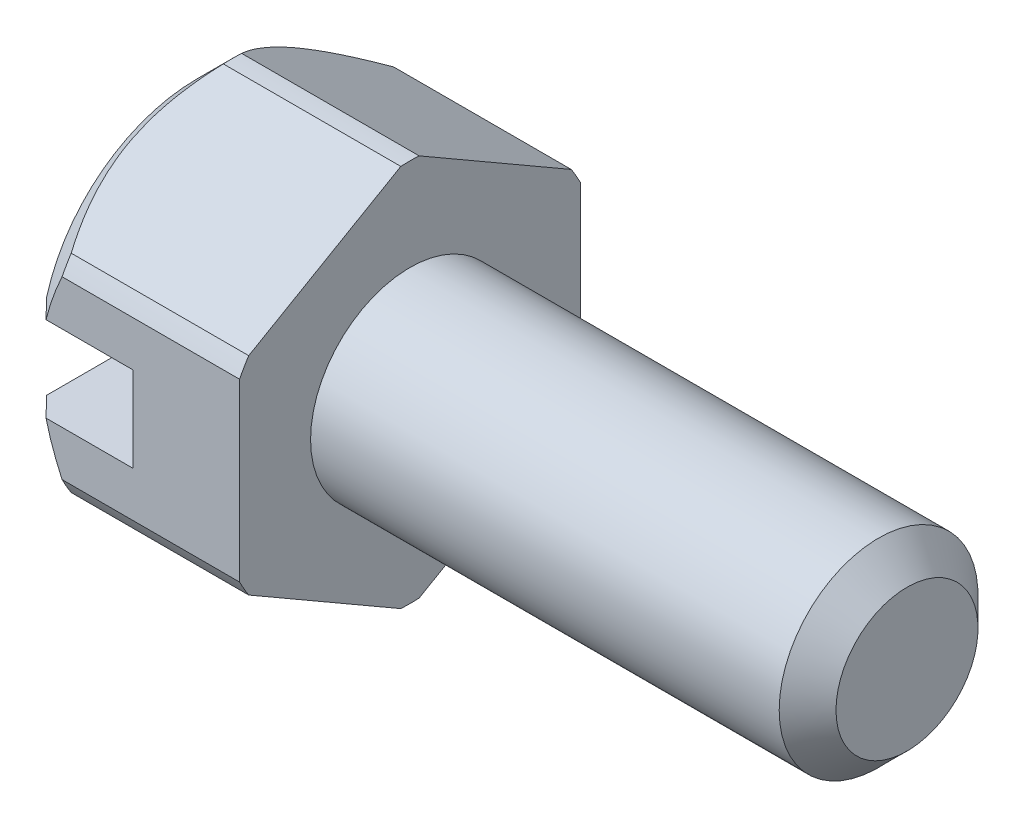
ISO-10303-21;
HEADER;
FILE_DESCRIPTION(('STEP AP214'),'2;1');
FILE_NAME('part.step','',(''),(''),'','','');
FILE_SCHEMA(('AUTOMOTIVE_DESIGN { 1 0 10303 214 1 1 1 1 }'));
ENDSEC;
DATA;
#1=APPLICATION_CONTEXT('core data for automotive mechanical design processes');
#2=APPLICATION_PROTOCOL_DEFINITION('international standard','automotive_design',2000,#1);
#3=PRODUCT_CONTEXT('',#1,'mechanical');
#4=PRODUCT('Part','Part','',(#3));
#5=PRODUCT_RELATED_PRODUCT_CATEGORY('part','',(#4));
#6=PRODUCT_DEFINITION_FORMATION('','',#4);
#7=PRODUCT_DEFINITION_CONTEXT('part definition',#1,'design');
#8=PRODUCT_DEFINITION('design','',#6,#7);
#9=PRODUCT_DEFINITION_SHAPE('','',#8);
#10=(LENGTH_UNIT() NAMED_UNIT(*) SI_UNIT(.MILLI.,.METRE.));
#11=(NAMED_UNIT(*) PLANE_ANGLE_UNIT() SI_UNIT($,.RADIAN.));
#12=(NAMED_UNIT(*) SI_UNIT($,.STERADIAN.) SOLID_ANGLE_UNIT());
#13=UNCERTAINTY_MEASURE_WITH_UNIT(LENGTH_MEASURE(1.E-05),#10,'distance_accuracy_value','');
#14=(GEOMETRIC_REPRESENTATION_CONTEXT(3) GLOBAL_UNCERTAINTY_ASSIGNED_CONTEXT((#13)) GLOBAL_UNIT_ASSIGNED_CONTEXT((#10,
#11,#12)) REPRESENTATION_CONTEXT('',''));
#15=CARTESIAN_POINT('',(0.,0.,0.));
#16=DIRECTION('',(0.,0.,1.));
#17=DIRECTION('',(1.,0.,0.));
#18=AXIS2_PLACEMENT_3D('',#15,#16,#17);
#19=CARTESIAN_POINT('',(-1.29409529997819,0.,0.));
#20=DIRECTION('',(-1.,0.,0.));
#21=DIRECTION('',(0.,0.,1.));
#22=AXIS2_PLACEMENT_3D('',#19,#20,#21);
#23=CYLINDRICAL_SURFACE('',#22,2.7);
#24=CARTESIAN_POINT('',(0.500000000000001,0.,0.));
#25=DIRECTION('',(-1.,0.,0.));
#26=DIRECTION('',(0.,0.,1.));
#27=AXIS2_PLACEMENT_3D('',#24,#25,#26);
#28=CIRCLE('',#27,2.7);
#29=CARTESIAN_POINT('',(0.500000000000001,-1.45999512524001,-2.27121426428142));
#30=VERTEX_POINT('',#29);
#31=CARTESIAN_POINT('',(0.500000000000001,-1.23693168768529,-2.4));
#32=VERTEX_POINT('',#31);
#33=EDGE_CURVE('E175',#30,#32,#28,.F.);
#34=ORIENTED_EDGE('',*,*,#33,.T.);
#35=DIRECTION('',(1.,0.,0.));
#36=VECTOR('',#35,1.);
#37=CARTESIAN_POINT('',(0.,-1.23693168768529,-2.4));
#38=LINE('',#37,#36);
#39=CARTESIAN_POINT('',(3.,-1.23693168768529,-2.4));
#40=VERTEX_POINT('',#39);
#41=EDGE_CURVE('E161',#32,#40,#38,.T.);
#42=ORIENTED_EDGE('',*,*,#41,.T.);
#43=CARTESIAN_POINT('',(3.,0.,0.));
#44=DIRECTION('',(-1.,0.,0.));
#45=DIRECTION('',(0.,0.,1.));
#46=AXIS2_PLACEMENT_3D('',#43,#44,#45);
#47=CIRCLE('',#46,2.7);
#48=CARTESIAN_POINT('',(3.,-1.45999512524001,-2.27121426428142));
#49=VERTEX_POINT('',#48);
#50=EDGE_CURVE('E172',#40,#49,#47,.T.);
#51=ORIENTED_EDGE('',*,*,#50,.T.);
#52=DIRECTION('',(1.,0.,0.));
#53=VECTOR('',#52,1.);
#54=CARTESIAN_POINT('',(0.,-1.45999512524001,-2.27121426428142));
#55=LINE('',#54,#53);
#56=EDGE_CURVE('E301',#30,#49,#55,.T.);
#57=ORIENTED_EDGE('',*,*,#56,.F.);
#58=EDGE_LOOP('',(#34,#42,#51,#57));
#59=FACE_BOUND('',#58,.T.);
#60=ADVANCED_FACE('F35',(#59),#23,.T.);
#61=CARTESIAN_POINT('',(3.,1.45999512524001,-2.27121426428142));
#62=VERTEX_POINT('',#61);
#63=CARTESIAN_POINT('',(3.,1.23693168768529,-2.4));
#64=VERTEX_POINT('',#63);
#65=EDGE_CURVE('E181',#62,#64,#47,.T.);
#66=ORIENTED_EDGE('',*,*,#65,.T.);
#67=DIRECTION('',(1.,0.,0.));
#68=VECTOR('',#67,1.);
#69=CARTESIAN_POINT('',(0.,1.23693168768529,-2.4));
#70=LINE('',#69,#68);
#71=CARTESIAN_POINT('',(0.500000000000001,1.23693168768529,-2.4));
#72=VERTEX_POINT('',#71);
#73=EDGE_CURVE('E163',#72,#64,#70,.T.);
#74=ORIENTED_EDGE('',*,*,#73,.F.);
#75=CARTESIAN_POINT('',(0.500000000000001,0.,0.));
#76=DIRECTION('',(-1.,0.,0.));
#77=DIRECTION('',(0.,0.,1.));
#78=AXIS2_PLACEMENT_3D('',#75,#76,#77);
#79=CIRCLE('',#78,2.7);
#80=CARTESIAN_POINT('',(0.500000000000001,1.45999512524001,-2.27121426428142));
#81=VERTEX_POINT('',#80);
#82=EDGE_CURVE('E415',#72,#81,#79,.F.);
#83=ORIENTED_EDGE('',*,*,#82,.T.);
#84=DIRECTION('',(1.,0.,0.));
#85=VECTOR('',#84,1.);
#86=CARTESIAN_POINT('',(0.,1.45999512524001,-2.27121426428142));
#87=LINE('',#86,#85);
#88=EDGE_CURVE('E349',#81,#62,#87,.T.);
#89=ORIENTED_EDGE('',*,*,#88,.T.);
#90=EDGE_LOOP('',(#66,#74,#83,#89));
#91=FACE_BOUND('',#90,.T.);
#92=ADVANCED_FACE('F394',(#91),#23,.T.);
#93=CARTESIAN_POINT('',(3.,-6.84812353516883,0.));
#94=DIRECTION('',(1.,0.,0.));
#95=DIRECTION('',(0.,0.,-1.));
#96=AXIS2_PLACEMENT_3D('',#93,#94,#95);
#97=PLANE('',#96);
#98=CARTESIAN_POINT('',(3.,0.,0.));
#99=DIRECTION('',(-1.,0.,0.));
#100=DIRECTION('',(0.,0.,1.));
#101=AXIS2_PLACEMENT_3D('',#98,#99,#100);
#102=CIRCLE('',#101,1.4);
#103=CARTESIAN_POINT('',(3.,0.,1.4));
#104=VERTEX_POINT('',#103);
#105=EDGE_CURVE('E184',#104,#104,#102,.T.);
#106=ORIENTED_EDGE('',*,*,#105,.T.);
#107=EDGE_LOOP('',(#106));
#108=FACE_BOUND('',#107,.T.);
#109=ORIENTED_EDGE('',*,*,#50,.F.);
#110=DIRECTION('',(0.,1.,0.));
#111=VECTOR('',#110,1.);
#112=CARTESIAN_POINT('',(3.,0.,-2.4));
#113=LINE('',#112,#111);
#114=EDGE_CURVE('E158',#40,#64,#113,.T.);
#115=ORIENTED_EDGE('',*,*,#114,.T.);
#116=ORIENTED_EDGE('',*,*,#65,.F.);
#117=DIRECTION('',(0.,0.5,0.866025403784439));
#118=VECTOR('',#117,1.);
#119=CARTESIAN_POINT('',(3.,-0.554871723726707,-5.76106601717798));
#120=LINE('',#119,#118);
#121=CARTESIAN_POINT('',(3.,2.6969268129253,-0.128785735718578));
#122=VERTEX_POINT('',#121);
#123=EDGE_CURVE('E361',#62,#122,#120,.T.);
#124=ORIENTED_EDGE('',*,*,#123,.T.);
#125=CARTESIAN_POINT('',(3.,2.6969268129253,0.128785735718576));
#126=VERTEX_POINT('',#125);
#127=EDGE_CURVE('E185',#126,#122,#47,.T.);
#128=ORIENTED_EDGE('',*,*,#127,.F.);
#129=DIRECTION('',(0.,-0.5,0.866025403784439));
#130=VECTOR('',#129,1.);
#131=CARTESIAN_POINT('',(3.,4.71179366189201,-3.36106601717798));
#132=LINE('',#131,#130);
#133=CARTESIAN_POINT('',(3.,1.45999512524001,2.27121426428142));
#134=VERTEX_POINT('',#133);
#135=EDGE_CURVE('E251',#126,#134,#132,.T.);
#136=ORIENTED_EDGE('',*,*,#135,.T.);
#137=CARTESIAN_POINT('',(3.,1.23693168768529,2.4));
#138=VERTEX_POINT('',#137);
#139=EDGE_CURVE('E375',#138,#134,#47,.T.);
#140=ORIENTED_EDGE('',*,*,#139,.F.);
#141=DIRECTION('',(0.,-1.,0.));
#142=VECTOR('',#141,1.);
#143=CARTESIAN_POINT('',(3.,0.,2.4));
#144=LINE('',#143,#142);
#145=CARTESIAN_POINT('',(3.,-1.23693168768529,2.4));
#146=VERTEX_POINT('',#145);
#147=EDGE_CURVE('E311',#138,#146,#144,.T.);
#148=ORIENTED_EDGE('',*,*,#147,.T.);
#149=CARTESIAN_POINT('',(3.,-1.45999512524001,2.27121426428142));
#150=VERTEX_POINT('',#149);
#151=EDGE_CURVE('E186',#150,#146,#47,.T.);
#152=ORIENTED_EDGE('',*,*,#151,.F.);
#153=DIRECTION('',(0.,-0.5,-0.866025403784439));
#154=VECTOR('',#153,1.);
#155=CARTESIAN_POINT('',(3.,-4.71179366189201,-3.36106601717798));
#156=LINE('',#155,#154);
#157=CARTESIAN_POINT('',(3.,-2.6969268129253,0.12878573571858));
#158=VERTEX_POINT('',#157);
#159=EDGE_CURVE('E303',#150,#158,#156,.T.);
#160=ORIENTED_EDGE('',*,*,#159,.T.);
#161=CARTESIAN_POINT('',(3.,-2.6969268129253,-0.128785735718579));
#162=VERTEX_POINT('',#161);
#163=EDGE_CURVE('E182',#162,#158,#47,.T.);
#164=ORIENTED_EDGE('',*,*,#163,.F.);
#165=DIRECTION('',(0.,0.5,-0.866025403784439));
#166=VECTOR('',#165,1.);
#167=CARTESIAN_POINT('',(3.,0.554871723726707,-5.76106601717798));
#168=LINE('',#167,#166);
#169=EDGE_CURVE('E180',#162,#49,#168,.T.);
#170=ORIENTED_EDGE('',*,*,#169,.T.);
#171=EDGE_LOOP('',(#109,#115,#116,#124,#128,#136,#140,#148,#152,#160,#164,#170));
#172=FACE_BOUND('',#171,.T.);
#173=ADVANCED_FACE('F178',(#108,#172),#97,.T.);
#174=CARTESIAN_POINT('',(0.,0.,0.));
#175=DIRECTION('',(1.,0.,0.));
#176=DIRECTION('',(0.,0.,-1.));
#177=AXIS2_PLACEMENT_3D('',#174,#175,#176);
#178=CONICAL_SURFACE('',#177,2.2,0.785398163397447);
#179=CARTESIAN_POINT('',(0.500000000000001,-0.600000000000001,-2.63248931621763));
#180=CARTESIAN_POINT('',(0.458205623346274,-0.600000000000001,-2.58962255504461));
#181=CARTESIAN_POINT('',(0.416436523717402,-0.600000000000001,-2.54673112550488));
#182=CARTESIAN_POINT('',(0.332958500682022,-0.600000000000001,-2.46088997810886));
#183=CARTESIAN_POINT('',(0.291249577112223,-0.600000000000001,-2.41794026041136));
#184=CARTESIAN_POINT('',(0.207901269067953,-0.600000000000001,-2.3319733191844));
#185=CARTESIAN_POINT('',(0.166261884646812,-0.600000000000001,-2.28895609560323));
#186=CARTESIAN_POINT('',(0.0830656969410431,-0.600000000000001,-2.20284164705896));
#187=CARTESIAN_POINT('',(0.0415088938817218,-0.600000000000001,-2.15974442187822));
#188=CARTESIAN_POINT('',(0.,-0.600000000000001,-2.11660104885167));
#189=B_SPLINE_CURVE_WITH_KNOTS('',3,(#179,#180,#181,#182,#183,#184,#185,#186,#187,#188),
.UNSPECIFIED.,.F.,.F.,(4,2,2,2,4),(0.,0.179607814676933,0.359215141059804,0.538822605124489,
0.718430558540017),.UNSPECIFIED.);
#190=CARTESIAN_POINT('',(0.2738633753706,-0.600000000000001,-2.4));
#191=VERTEX_POINT('',#190);
#192=CARTESIAN_POINT('',(0.,-0.600000000000001,-2.11660104885167));
#193=VERTEX_POINT('',#192);
#194=EDGE_CURVE('E423',#191,#193,#189,.T.);
#195=ORIENTED_EDGE('',*,*,#194,.F.);
#196=CARTESIAN_POINT('',(0.201804902388567,-0.0930955913979796,-2.4));
#197=CARTESIAN_POINT('',(0.204690686300669,-0.169077783220322,-2.4));
#198=CARTESIAN_POINT('',(0.211287038129602,-0.244862421400538,-2.4));
#199=CARTESIAN_POINT('',(0.231228630885197,-0.395417421849185,-2.4));
#200=CARTESIAN_POINT('',(0.244562485860121,-0.470189277481146,-2.4));
#201=CARTESIAN_POINT('',(0.277156211236744,-0.617613506591587,-2.4));
#202=CARTESIAN_POINT('',(0.296355115633669,-0.690279634964505,-2.4));
#203=CARTESIAN_POINT('',(0.339873412053064,-0.834055558973758,-2.4));
#204=CARTESIAN_POINT('',(0.364193140286129,-0.905165252082872,-2.4));
#205=CARTESIAN_POINT('',(0.400086759472874,-1.0004949660326,-2.4));
#206=CARTESIAN_POINT('',(0.409789726952231,-1.02543708476018,-2.4));
#207=CARTESIAN_POINT('',(0.429716568238817,-1.07514050637192,-2.4));
#208=CARTESIAN_POINT('',(0.439940931919612,-1.09990161325714,-2.4));
#209=CARTESIAN_POINT('',(0.500784539903967,-1.24330812721507,-2.4));
#210=CARTESIAN_POINT('',(0.556697409015825,-1.35973039337568,-2.4));
#211=CARTESIAN_POINT('',(0.676445566587342,-1.58854025480397,-2.4));
#212=CARTESIAN_POINT('',(0.740293095341301,-1.70092126278834,-2.4));
#213=CARTESIAN_POINT('',(0.873229240534744,-1.92157114990814,-2.4));
#214=CARTESIAN_POINT('',(0.942283021312075,-2.0298611531731,-2.4));
#215=CARTESIAN_POINT('',(1.04880827538389,-2.19005241910346,-2.4));
#216=CARTESIAN_POINT('',(1.08474462784781,-2.24298849174704,-2.4));
#217=CARTESIAN_POINT('',(1.15749738292703,-2.34823998566062,-2.4));
#218=CARTESIAN_POINT('',(1.19431363933188,-2.40055550791302,-2.4));
#219=CARTESIAN_POINT('',(1.23150867221835,-2.45260102085718,-2.4));
#220=B_SPLINE_CURVE_WITH_KNOTS('',3,(#196,#197,#198,#199,#200,#201,#202,#203,#204,#205,#206,
#207,#208,#209,#210,#211,#212,#213,#214,#215,#216,#217,#218,#219),.UNSPECIFIED.,.F.,.F.,(4,2,2,
2,2,2,2,2,2,2,2,4),(0.,0.227940095032987,0.455496267707126,0.680763193857728,0.90604491465045,
0.986330425981595,1.06669281092924,1.45364870741549,1.84120912360464,2.22637395048069,
2.41831253149034,2.61021943751267),.UNSPECIFIED.);
#221=EDGE_CURVE('E51',#191,#32,#220,.T.);
#222=ORIENTED_EDGE('',*,*,#221,.T.);
#223=ORIENTED_EDGE('',*,*,#33,.F.);
#224=CARTESIAN_POINT('',(0.500105806743066,-1.45987965518617,-2.27141426428142));
#225=CARTESIAN_POINT('',(0.460186321924043,-1.50345775688212,-2.19593477804663));
#226=CARTESIAN_POINT('',(0.422941975718891,-1.54772090981922,-2.11926874825638));
#227=CARTESIAN_POINT('',(0.355366684193153,-1.63774839739655,-1.96333656569467));
#228=CARTESIAN_POINT('',(0.32506534209904,-1.68351824211686,-1.88406086918456));
#229=CARTESIAN_POINT('',(0.273636147469388,-1.77572568221965,-1.72435289809066));
#230=CARTESIAN_POINT('',(0.252394998240326,-1.822147046811,-1.64394873606177));
#231=CARTESIAN_POINT('',(0.220193291982944,-1.91581285983523,-1.48171478897156));
#232=CARTESIAN_POINT('',(0.209215062363481,-1.9630557501449,-1.3998877026588));
#233=CARTESIAN_POINT('',(0.198906649482594,-2.05414413687459,-1.24211798886349));
#234=CARTESIAN_POINT('',(0.198730574550501,-2.097965541777,-1.16621708911347));
#235=CARTESIAN_POINT('',(0.207923919089805,-2.18537576368575,-1.01481814366665));
#236=CARTESIAN_POINT('',(0.217298387079905,-2.22896444542212,-0.939320332264305));
#237=CARTESIAN_POINT('',(0.244853680784973,-2.31542450152004,-0.78956712227745));
#238=CARTESIAN_POINT('',(0.263034701190548,-2.35829586000171,-0.715311751197701));
#239=CARTESIAN_POINT('',(0.306991608409519,-2.44305635496715,-0.568502267442875));
#240=CARTESIAN_POINT('',(0.332770569191491,-2.48494508648087,-0.49594885619649));
#241=CARTESIAN_POINT('',(0.381987287772678,-2.55533303620112,-0.374033351040428));
#242=CARTESIAN_POINT('',(0.403847131299759,-2.58411458339704,-0.324182248976646));
#243=CARTESIAN_POINT('',(0.450142320837504,-2.64103079418323,-0.225600480120671));
#244=CARTESIAN_POINT('',(0.474567684276425,-2.66916748152527,-0.176866308087573));
#245=CARTESIAN_POINT('',(0.500105806742765,-2.69704228297919,-0.128585735718487));
#246=B_SPLINE_CURVE_WITH_KNOTS('',3,(#224,#225,#226,#227,#228,#229,#230,#231,#232,#233,#234,
#235,#236,#237,#238,#239,#240,#241,#242,#243,#244,#245),.UNSPECIFIED.,.F.,.F.,(4,2,2,2,2,2,2,2,
2,2,4),(0.,0.28774371572614,0.576692369207171,0.861913546336944,1.14664266732951,
1.40904434452108,1.67158480204139,1.93413106393236,2.19678369272847,2.38144235822914,
2.56540740561911),.UNSPECIFIED.);
#247=CARTESIAN_POINT('',(0.500000000000001,-2.6969268129253,-0.128785735718579));
#248=VERTEX_POINT('',#247);
#249=EDGE_CURVE('E44',#30,#248,#246,.T.);
#250=ORIENTED_EDGE('',*,*,#249,.T.);
#251=CARTESIAN_POINT('',(0.500000000000001,-2.6969268129253,0.12878573571858));
#252=VERTEX_POINT('',#251);
#253=EDGE_CURVE('E598',#252,#248,#28,.F.);
#254=ORIENTED_EDGE('',*,*,#253,.F.);
#255=CARTESIAN_POINT('',(0.500105806743065,-2.69704228297914,0.12858573571858));
#256=CARTESIAN_POINT('',(0.460186321924043,-2.65346418128318,0.204065221953374));
#257=CARTESIAN_POINT('',(0.422941975718891,-2.60920102834608,0.280731251743622));
#258=CARTESIAN_POINT('',(0.355366684193153,-2.51917354076876,0.436663434305331));
#259=CARTESIAN_POINT('',(0.32506534209904,-2.47340369604845,0.515939130815445));
#260=CARTESIAN_POINT('',(0.273636147469387,-2.38119625594566,0.675647101909339));
#261=CARTESIAN_POINT('',(0.252394998240326,-2.33477489135431,0.756051263938233));
#262=CARTESIAN_POINT('',(0.220193291982944,-2.24110907833008,0.918285211028446));
#263=CARTESIAN_POINT('',(0.209215062363481,-2.19386618802041,1.0001122973412));
#264=CARTESIAN_POINT('',(0.198906649482595,-2.10277780129071,1.15788201113651));
#265=CARTESIAN_POINT('',(0.198730574550501,-2.0589563963883,1.23378291088654));
#266=CARTESIAN_POINT('',(0.207923919089805,-1.97154617447956,1.38518185633335));
#267=CARTESIAN_POINT('',(0.217298387079905,-1.92795749274319,1.4606796677357));
#268=CARTESIAN_POINT('',(0.244853680784973,-1.84149743664527,1.61043287772255));
#269=CARTESIAN_POINT('',(0.263034701190548,-1.7986260781636,1.6846882488023));
#270=CARTESIAN_POINT('',(0.306991608409518,-1.71386558319816,1.83149773255713));
#271=CARTESIAN_POINT('',(0.33277056919149,-1.67197685168443,1.90405114380351));
#272=CARTESIAN_POINT('',(0.381987287772677,-1.60158890196419,2.02596664895957));
#273=CARTESIAN_POINT('',(0.403847131299758,-1.57280735476827,2.07581775102335));
#274=CARTESIAN_POINT('',(0.450142320837503,-1.51589114398208,2.17439951987933));
#275=CARTESIAN_POINT('',(0.474567684276424,-1.48775445664004,2.22313369191243));
#276=CARTESIAN_POINT('',(0.500105806742765,-1.45987965518612,2.27141426428151));
#277=B_SPLINE_CURVE_WITH_KNOTS('',3,(#255,#256,#257,#258,#259,#260,#261,#262,#263,#264,#265,
#266,#267,#268,#269,#270,#271,#272,#273,#274,#275,#276),.UNSPECIFIED.,.F.,.F.,(4,2,2,2,2,2,2,2,
2,2,4),(0.,0.28774371572614,0.57669236920717,0.861913546336943,1.14664266732951,
1.40904434452107,1.67158480204138,1.93413106393235,2.19678369272847,2.38144235822914,
2.56540740561911),.UNSPECIFIED.);
#278=CARTESIAN_POINT('',(0.500000000000001,-1.45999512524001,2.27121426428142));
#279=VERTEX_POINT('',#278);
#280=EDGE_CURVE('E272',#252,#279,#277,.T.);
#281=ORIENTED_EDGE('',*,*,#280,.T.);
#282=CARTESIAN_POINT('',(0.500000000000001,-1.23693168768529,2.4));
#283=VERTEX_POINT('',#282);
#284=EDGE_CURVE('E419',#283,#279,#28,.F.);
#285=ORIENTED_EDGE('',*,*,#284,.F.);
#286=CARTESIAN_POINT('',(1.23150867221835,-2.45260102085718,2.4));
#287=CARTESIAN_POINT('',(1.19368536216901,-2.39967629797189,2.4));
#288=CARTESIAN_POINT('',(1.15625361015432,-2.34647231477684,2.4));
#289=CARTESIAN_POINT('',(1.08230207661633,-2.239421448554,2.4));
#290=CARTESIAN_POINT('',(1.0457824511911,-2.18557445778347,2.4));
#291=CARTESIAN_POINT('',(0.937610114875952,-2.02267714777495,2.4));
#292=CARTESIAN_POINT('',(0.867549449000538,-1.91255515975906,2.4));
#293=CARTESIAN_POINT('',(0.735034994999204,-1.69175136681705,2.4));
#294=CARTESIAN_POINT('',(0.672428814333666,-1.58116174726147,2.4));
#295=CARTESIAN_POINT('',(0.554905338868138,-1.35599498517619,2.4));
#296=CARTESIAN_POINT('',(0.499981981453448,-1.24142107687335,2.4));
#297=CARTESIAN_POINT('',(0.415991728050313,-1.04345091402085,2.4));
#298=CARTESIAN_POINT('',(0.384154778573902,-0.961238623411974,2.4));
#299=CARTESIAN_POINT('',(0.326927055981317,-0.794653609277436,2.4));
#300=CARTESIAN_POINT('',(0.301530434360806,-0.710282923025454,2.4));
#301=CARTESIAN_POINT('',(0.258136228953582,-0.538033856260893,2.4));
#302=CARTESIAN_POINT('',(0.240275538240141,-0.450119954408544,2.4));
#303=CARTESIAN_POINT('',(0.220453252389499,-0.317068280942172,2.4));
#304=CARTESIAN_POINT('',(0.215003588665089,-0.27243474355903,2.4));
#305=CARTESIAN_POINT('',(0.206546732364611,-0.182919518098874,2.4));
#306=CARTESIAN_POINT('',(0.203540523602889,-0.13803773738627,2.4));
#307=CARTESIAN_POINT('',(0.201804902388567,-0.0930955913979801,2.4));
#308=B_SPLINE_CURVE_WITH_KNOTS('',3,(#286,#287,#288,#289,#290,#291,#292,#293,#294,#295,#296,
#297,#298,#299,#300,#301,#302,#303,#304,#305,#306,#307),.UNSPECIFIED.,.F.,.F.,(4,2,2,2,2,2,2,2,
2,2,4),(0.,0.195148777495896,0.390330726336203,0.781747316458154,1.16279032323807,
1.54353092704248,1.80780320981392,2.071834638775,2.34047489887005,2.47530983287809,
2.61019902895551),.UNSPECIFIED.);
#309=CARTESIAN_POINT('',(0.2738633753706,-0.600000000000001,2.4));
#310=VERTEX_POINT('',#309);
#311=EDGE_CURVE('E266',#283,#310,#308,.T.);
#312=ORIENTED_EDGE('',*,*,#311,.T.);
#313=CARTESIAN_POINT('',(0.,-0.600000000000001,2.11660104885167));
#314=CARTESIAN_POINT('',(0.0415088938817216,-0.600000000000001,2.15974442187822));
#315=CARTESIAN_POINT('',(0.0830656969410429,-0.600000000000001,2.20284164705896));
#316=CARTESIAN_POINT('',(0.166261884646811,-0.600000000000001,2.28895609560323));
#317=CARTESIAN_POINT('',(0.207901269067952,-0.600000000000001,2.3319733191844));
#318=CARTESIAN_POINT('',(0.291249577112223,-0.600000000000001,2.41794026041136));
#319=CARTESIAN_POINT('',(0.332958500682022,-0.600000000000001,2.46088997810886));
#320=CARTESIAN_POINT('',(0.416436523717402,-0.600000000000001,2.54673112550488));
#321=CARTESIAN_POINT('',(0.458205623346274,-0.600000000000001,2.58962255504461));
#322=CARTESIAN_POINT('',(0.500000000000001,-0.600000000000001,2.63248931621763));
#323=B_SPLINE_CURVE_WITH_KNOTS('',3,(#313,#314,#315,#316,#317,#318,#319,#320,#321,#322),
.UNSPECIFIED.,.F.,.F.,(4,2,2,2,4),(0.,0.179607953415528,0.359215417480214,0.538822743863084,
0.718430558540017),.UNSPECIFIED.);
#324=CARTESIAN_POINT('',(0.,-0.600000000000001,2.11660104885167));
#325=VERTEX_POINT('',#324);
#326=EDGE_CURVE('E427',#325,#310,#323,.T.);
#327=ORIENTED_EDGE('',*,*,#326,.F.);
#328=CARTESIAN_POINT('',(0.,0.,0.));
#329=DIRECTION('',(-1.,0.,0.));
#330=DIRECTION('',(0.,0.,1.));
#331=AXIS2_PLACEMENT_3D('',#328,#329,#330);
#332=CIRCLE('',#331,2.2);
#333=EDGE_CURVE('E418',#193,#325,#332,.T.);
#334=ORIENTED_EDGE('',*,*,#333,.F.);
#335=EDGE_LOOP('',(#195,#222,#223,#250,#254,#281,#285,#312,#327,#334));
#336=FACE_BOUND('',#335,.T.);
#337=ADVANCED_FACE('F37',(#336),#178,.T.);
#338=CARTESIAN_POINT('',(0.,0.,0.));
#339=DIRECTION('',(1.,0.,0.));
#340=DIRECTION('',(0.,0.,-1.));
#341=AXIS2_PLACEMENT_3D('',#338,#339,#340);
#342=CONICAL_SURFACE('',#341,2.2,0.785398163397447);
#343=ORIENTED_EDGE('',*,*,#82,.F.);
#344=CARTESIAN_POINT('',(0.846751823401935,1.87688483221613,-2.4));
#345=CARTESIAN_POINT('',(0.817972413385958,1.83016159622166,-2.4));
#346=CARTESIAN_POINT('',(0.78967156648678,1.78314438060789,-2.4));
#347=CARTESIAN_POINT('',(0.734173540165338,1.68844615549788,-2.4));
#348=CARTESIAN_POINT('',(0.706976670694421,1.64076496456261,-2.4));
#349=CARTESIAN_POINT('',(0.627066929351198,1.49625528677627,-2.4));
#350=CARTESIAN_POINT('',(0.576274607431222,1.39834455834726,-2.4));
#351=CARTESIAN_POINT('',(0.482892219946306,1.20213789847663,-2.4));
#352=CARTESIAN_POINT('',(0.440106584922421,1.10393596681179,-2.4));
#353=CARTESIAN_POINT('',(0.363081930969527,0.904339622620174,-2.4));
#354=CARTESIAN_POINT('',(0.328828234103392,0.802951035550951,-2.4));
#355=CARTESIAN_POINT('',(0.283480376583782,0.641005326461181,-2.4));
#356=CARTESIAN_POINT('',(0.268737899074423,0.581464335997295,-2.4));
#357=CARTESIAN_POINT('',(0.243270365988632,0.461524253319888,-2.4));
#358=CARTESIAN_POINT('',(0.23254487671606,0.40112525447292,-2.4));
#359=CARTESIAN_POINT('',(0.21536153472968,0.278725516387459,-2.4));
#360=CARTESIAN_POINT('',(0.208975034296639,0.216714635028998,-2.4));
#361=CARTESIAN_POINT('',(0.200963231303398,0.0923261566910851,-2.4));
#362=CARTESIAN_POINT('',(0.199342704630754,0.0299482545849741,-2.4));
#363=CARTESIAN_POINT('',(0.2002188345231,-0.0324107019272284,-2.4));
#364=B_SPLINE_CURVE_WITH_KNOTS('',3,(#344,#345,#346,#347,#348,#349,#350,#351,#352,#353,#354,
#355,#356,#357,#358,#359,#360,#361,#362,#363),.UNSPECIFIED.,.F.,.F.,(4,2,2,2,2,2,2,2,2,4),(0.,
0.164620021267679,0.329285945809777,0.659973989259377,0.981045612539424,1.30156100414939,
1.4854613054535,1.66934174614224,1.85617720763996,2.0431998295541),.UNSPECIFIED.);
#365=CARTESIAN_POINT('',(0.2738633753706,0.600000000000001,-2.4));
#366=VERTEX_POINT('',#365);
#367=EDGE_CURVE('E293',#72,#366,#364,.T.);
#368=ORIENTED_EDGE('',*,*,#367,.T.);
#369=CARTESIAN_POINT('',(0.,0.600000000000001,-2.11660104885167));
#370=CARTESIAN_POINT('',(0.0415088938817216,0.600000000000001,-2.15974442187822));
#371=CARTESIAN_POINT('',(0.0830656969410429,0.600000000000001,-2.20284164705896));
#372=CARTESIAN_POINT('',(0.166261884646811,0.600000000000001,-2.28895609560323));
#373=CARTESIAN_POINT('',(0.207901269067952,0.600000000000001,-2.3319733191844));
#374=CARTESIAN_POINT('',(0.291249577112223,0.600000000000001,-2.41794026041136));
#375=CARTESIAN_POINT('',(0.332958500682022,0.600000000000001,-2.46088997810886));
#376=CARTESIAN_POINT('',(0.416436523717402,0.600000000000001,-2.54673112550488));
#377=CARTESIAN_POINT('',(0.458205623346274,0.600000000000001,-2.58962255504461));
#378=CARTESIAN_POINT('',(0.500000000000001,0.600000000000001,-2.63248931621763));
#379=B_SPLINE_CURVE_WITH_KNOTS('',3,(#369,#370,#371,#372,#373,#374,#375,#376,#377,#378),
.UNSPECIFIED.,.F.,.F.,(4,2,2,2,4),(0.,0.179607953415528,0.359215417480214,0.538822743863084,
0.718430558540017),.UNSPECIFIED.);
#380=CARTESIAN_POINT('',(0.,0.600000000000001,-2.11660104885167));
#381=VERTEX_POINT('',#380);
#382=EDGE_CURVE('E205',#381,#366,#379,.T.);
#383=ORIENTED_EDGE('',*,*,#382,.F.);
#384=CARTESIAN_POINT('',(0.,0.,0.));
#385=DIRECTION('',(-1.,0.,0.));
#386=DIRECTION('',(0.,0.,1.));
#387=AXIS2_PLACEMENT_3D('',#384,#385,#386);
#388=CIRCLE('',#387,2.2);
#389=CARTESIAN_POINT('',(0.,0.600000000000001,2.11660104885167));
#390=VERTEX_POINT('',#389);
#391=EDGE_CURVE('E196',#390,#381,#388,.T.);
#392=ORIENTED_EDGE('',*,*,#391,.F.);
#393=CARTESIAN_POINT('',(0.500000000000001,0.600000000000001,2.63248931621763));
#394=CARTESIAN_POINT('',(0.458205623346274,0.600000000000001,2.58962255504461));
#395=CARTESIAN_POINT('',(0.416436523717402,0.600000000000001,2.54673112550488));
#396=CARTESIAN_POINT('',(0.332958500682022,0.600000000000001,2.46088997810886));
#397=CARTESIAN_POINT('',(0.291249577112223,0.600000000000001,2.41794026041136));
#398=CARTESIAN_POINT('',(0.207901269067953,0.600000000000001,2.3319733191844));
#399=CARTESIAN_POINT('',(0.166261884646812,0.600000000000001,2.28895609560323));
#400=CARTESIAN_POINT('',(0.0830656969410431,0.600000000000001,2.20284164705896));
#401=CARTESIAN_POINT('',(0.0415088938817218,0.600000000000001,2.15974442187822));
#402=CARTESIAN_POINT('',(0.,0.600000000000001,2.11660104885167));
#403=B_SPLINE_CURVE_WITH_KNOTS('',3,(#393,#394,#395,#396,#397,#398,#399,#400,#401,#402),
.UNSPECIFIED.,.F.,.F.,(4,2,2,2,4),(0.,0.179607814676933,0.359215141059804,0.538822605124489,
0.718430558540017),.UNSPECIFIED.);
#404=CARTESIAN_POINT('',(0.2738633753706,0.600000000000001,2.4));
#405=VERTEX_POINT('',#404);
#406=EDGE_CURVE('E199',#405,#390,#403,.T.);
#407=ORIENTED_EDGE('',*,*,#406,.F.);
#408=CARTESIAN_POINT('',(0.2002188345231,-0.0324107019272285,2.4));
#409=CARTESIAN_POINT('',(0.199342704630754,0.029948254584974,2.4));
#410=CARTESIAN_POINT('',(0.200963231303398,0.0923261566910849,2.4));
#411=CARTESIAN_POINT('',(0.208975034296639,0.216714635028998,2.4));
#412=CARTESIAN_POINT('',(0.21536153472968,0.278725516387458,2.4));
#413=CARTESIAN_POINT('',(0.23254487671606,0.40112525447292,2.4));
#414=CARTESIAN_POINT('',(0.243270365988632,0.461524253319888,2.4));
#415=CARTESIAN_POINT('',(0.268737899074423,0.581464335997295,2.4));
#416=CARTESIAN_POINT('',(0.283480376583782,0.641005326461181,2.4));
#417=CARTESIAN_POINT('',(0.328828234103393,0.80295103555095,2.4));
#418=CARTESIAN_POINT('',(0.363081930969527,0.904339622620174,2.4));
#419=CARTESIAN_POINT('',(0.440106584922421,1.10393596681179,2.4));
#420=CARTESIAN_POINT('',(0.482892219946306,1.20213789847663,2.4));
#421=CARTESIAN_POINT('',(0.576274607431222,1.39834455834726,2.4));
#422=CARTESIAN_POINT('',(0.627066929351198,1.49625528677627,2.4));
#423=CARTESIAN_POINT('',(0.706976670694421,1.64076496456261,2.4));
#424=CARTESIAN_POINT('',(0.734173540165338,1.68844615549788,2.4));
#425=CARTESIAN_POINT('',(0.78967156648678,1.78314438060789,2.4));
#426=CARTESIAN_POINT('',(0.817972413385958,1.83016159622166,2.4));
#427=CARTESIAN_POINT('',(0.846751823401935,1.87688483221613,2.4));
#428=B_SPLINE_CURVE_WITH_KNOTS('',3,(#408,#409,#410,#411,#412,#413,#414,#415,#416,#417,#418,
#419,#420,#421,#422,#423,#424,#425,#426,#427),.UNSPECIFIED.,.F.,.F.,(4,2,2,2,2,2,2,2,2,4),(0.,
0.187022621914138,0.373858083411858,0.557738524100601,0.74163882540471,1.06215421701467,
1.38322584029472,1.71391388374432,1.87857980828642,2.0431998295541),.UNSPECIFIED.);
#429=CARTESIAN_POINT('',(0.500000000000001,1.23693168768529,2.4));
#430=VERTEX_POINT('',#429);
#431=EDGE_CURVE('E243',#405,#430,#428,.T.);
#432=ORIENTED_EDGE('',*,*,#431,.T.);
#433=CARTESIAN_POINT('',(0.500000000000001,1.45999512524001,2.27121426428142));
#434=VERTEX_POINT('',#433);
#435=EDGE_CURVE('E416',#434,#430,#79,.F.);
#436=ORIENTED_EDGE('',*,*,#435,.F.);
#437=CARTESIAN_POINT('',(0.500105806743066,1.45987965518617,2.27141426428142));
#438=CARTESIAN_POINT('',(0.460186321924043,1.50345775688212,2.19593477804663));
#439=CARTESIAN_POINT('',(0.422941975718891,1.54772090981922,2.11926874825638));
#440=CARTESIAN_POINT('',(0.355366684193152,1.63774839739655,1.96333656569467));
#441=CARTESIAN_POINT('',(0.325065342099039,1.68351824211686,1.88406086918456));
#442=CARTESIAN_POINT('',(0.273636147469386,1.77572568221965,1.72435289809066));
#443=CARTESIAN_POINT('',(0.252394998240325,1.82214704681099,1.64394873606177));
#444=CARTESIAN_POINT('',(0.220193291982943,1.91581285983523,1.48171478897156));
#445=CARTESIAN_POINT('',(0.20921506236348,1.9630557501449,1.3998877026588));
#446=CARTESIAN_POINT('',(0.198906649482593,2.05414413687459,1.24211798886349));
#447=CARTESIAN_POINT('',(0.198730574550499,2.097965541777,1.16621708911347));
#448=CARTESIAN_POINT('',(0.207923919089803,2.18537576368575,1.01481814366665));
#449=CARTESIAN_POINT('',(0.217298387079904,2.22896444542212,0.939320332264306));
#450=CARTESIAN_POINT('',(0.244853680784971,2.31542450152004,0.789567122277451));
#451=CARTESIAN_POINT('',(0.263034701190546,2.35829586000171,0.715311751197702));
#452=CARTESIAN_POINT('',(0.306991608409516,2.44305635496715,0.568502267442875));
#453=CARTESIAN_POINT('',(0.332770569191488,2.48494508648087,0.495948856196491));
#454=CARTESIAN_POINT('',(0.381987287772676,2.55533303620111,0.374033351040429));
#455=CARTESIAN_POINT('',(0.403847131299757,2.58411458339704,0.324182248976646));
#456=CARTESIAN_POINT('',(0.450142320837503,2.64103079418323,0.225600480120669));
#457=CARTESIAN_POINT('',(0.474567684276424,2.66916748152527,0.176866308087571));
#458=CARTESIAN_POINT('',(0.500105806742764,2.69704228297919,0.128585735718485));
#459=B_SPLINE_CURVE_WITH_KNOTS('',3,(#437,#438,#439,#440,#441,#442,#443,#444,#445,#446,#447,
#448,#449,#450,#451,#452,#453,#454,#455,#456,#457,#458),.UNSPECIFIED.,.F.,.F.,(4,2,2,2,2,2,2,2,
2,2,4),(0.,0.287743715726141,0.576692369207172,0.861913546336945,1.14664266732951,
1.40904434452108,1.67158480204139,1.93413106393236,2.19678369272847,2.38144235822915,
2.56540740561911),.UNSPECIFIED.);
#460=CARTESIAN_POINT('',(0.500000000000001,2.6969268129253,0.128785735718576));
#461=VERTEX_POINT('',#460);
#462=EDGE_CURVE('E236',#434,#461,#459,.T.);
#463=ORIENTED_EDGE('',*,*,#462,.T.);
#464=CARTESIAN_POINT('',(0.500000000000001,2.6969268129253,-0.128785735718578));
#465=VERTEX_POINT('',#464);
#466=EDGE_CURVE('E413',#465,#461,#79,.F.);
#467=ORIENTED_EDGE('',*,*,#466,.F.);
#468=CARTESIAN_POINT('',(0.500105806743066,2.69704228297914,-0.128585735718578));
#469=CARTESIAN_POINT('',(0.460186321924044,2.65346418128318,-0.204065221953373));
#470=CARTESIAN_POINT('',(0.422941975718892,2.60920102834609,-0.280731251743621));
#471=CARTESIAN_POINT('',(0.355366684193154,2.51917354076876,-0.43666343430533));
#472=CARTESIAN_POINT('',(0.32506534209904,2.47340369604845,-0.515939130815444));
#473=CARTESIAN_POINT('',(0.273636147469388,2.38119625594566,-0.675647101909338));
#474=CARTESIAN_POINT('',(0.252394998240326,2.33477489135431,-0.756051263938231));
#475=CARTESIAN_POINT('',(0.220193291982944,2.24110907833008,-0.918285211028445));
#476=CARTESIAN_POINT('',(0.209215062363481,2.19386618802041,-1.0001122973412));
#477=CARTESIAN_POINT('',(0.198906649482595,2.10277780129071,-1.15788201113651));
#478=CARTESIAN_POINT('',(0.198730574550502,2.0589563963883,-1.23378291088654));
#479=CARTESIAN_POINT('',(0.207923919089805,1.97154617447956,-1.38518185633335));
#480=CARTESIAN_POINT('',(0.217298387079905,1.92795749274319,-1.4606796677357));
#481=CARTESIAN_POINT('',(0.244853680784972,1.84149743664527,-1.61043287772255));
#482=CARTESIAN_POINT('',(0.263034701190548,1.7986260781636,-1.6846882488023));
#483=CARTESIAN_POINT('',(0.306991608409519,1.71386558319816,-1.83149773255713));
#484=CARTESIAN_POINT('',(0.33277056919149,1.67197685168443,-1.90405114380351));
#485=CARTESIAN_POINT('',(0.381987287772678,1.60158890196419,-2.02596664895957));
#486=CARTESIAN_POINT('',(0.403847131299758,1.57280735476827,-2.07581775102335));
#487=CARTESIAN_POINT('',(0.450142320837504,1.51589114398208,-2.17439951987933));
#488=CARTESIAN_POINT('',(0.474567684276425,1.48775445664004,-2.22313369191243));
#489=CARTESIAN_POINT('',(0.500105806742765,1.45987965518612,-2.27141426428151));
#490=B_SPLINE_CURVE_WITH_KNOTS('',3,(#468,#469,#470,#471,#472,#473,#474,#475,#476,#477,#478,
#479,#480,#481,#482,#483,#484,#485,#486,#487,#488,#489),.UNSPECIFIED.,.F.,.F.,(4,2,2,2,2,2,2,2,
2,2,4),(0.,0.28774371572614,0.576692369207171,0.861913546336944,1.14664266732951,
1.40904434452108,1.67158480204138,1.93413106393236,2.19678369272847,2.38144235822914,
2.56540740561911),.UNSPECIFIED.);
#491=EDGE_CURVE('E229',#465,#81,#490,.T.);
#492=ORIENTED_EDGE('',*,*,#491,.T.);
#493=EDGE_LOOP('',(#343,#368,#383,#392,#407,#432,#436,#463,#467,#492));
#494=FACE_BOUND('',#493,.T.);
#495=ADVANCED_FACE('F214',(#494),#342,.T.);
#496=CARTESIAN_POINT('',(1.5,-6.84812353516883,0.));
#497=DIRECTION('',(1.,0.,0.));
#498=DIRECTION('',(0.,0.,-1.));
#499=AXIS2_PLACEMENT_3D('',#496,#497,#498);
#500=PLANE('',#499);
#501=DIRECTION('',(0.,1.,0.));
#502=VECTOR('',#501,1.);
#503=CARTESIAN_POINT('',(1.5,-6.84812353516883,-2.4));
#504=LINE('',#503,#502);
#505=CARTESIAN_POINT('',(1.5,-0.600000000000001,-2.4));
#506=VERTEX_POINT('',#505);
#507=CARTESIAN_POINT('',(1.5,0.600000000000001,-2.4));
#508=VERTEX_POINT('',#507);
#509=EDGE_CURVE('E448',#506,#508,#504,.T.);
#510=ORIENTED_EDGE('',*,*,#509,.F.);
#511=DIRECTION('',(0.,0.,-1.));
#512=VECTOR('',#511,1.);
#513=CARTESIAN_POINT('',(1.5,-0.600000000000001,0.));
#514=LINE('',#513,#512);
#515=CARTESIAN_POINT('',(1.5,-0.600000000000001,2.4));
#516=VERTEX_POINT('',#515);
#517=EDGE_CURVE('E347',#516,#506,#514,.T.);
#518=ORIENTED_EDGE('',*,*,#517,.F.);
#519=DIRECTION('',(0.,-1.,0.));
#520=VECTOR('',#519,1.);
#521=CARTESIAN_POINT('',(1.5,-6.84812353516883,2.4));
#522=LINE('',#521,#520);
#523=CARTESIAN_POINT('',(1.5,0.600000000000001,2.4));
#524=VERTEX_POINT('',#523);
#525=EDGE_CURVE('E324',#524,#516,#522,.T.);
#526=ORIENTED_EDGE('',*,*,#525,.F.);
#527=DIRECTION('',(0.,0.,1.));
#528=VECTOR('',#527,1.);
#529=CARTESIAN_POINT('',(1.5,0.600000000000001,0.));
#530=LINE('',#529,#528);
#531=EDGE_CURVE('E335',#508,#524,#530,.T.);
#532=ORIENTED_EDGE('',*,*,#531,.F.);
#533=EDGE_LOOP('',(#510,#518,#526,#532));
#534=FACE_BOUND('',#533,.T.);
#535=ADVANCED_FACE('F218',(#534),#500,.F.);
#536=CARTESIAN_POINT('',(8.53172667437573,0.600000000000001,0.));
#537=DIRECTION('',(0.,-1.,0.));
#538=DIRECTION('',(0.,0.,-1.));
#539=AXIS2_PLACEMENT_3D('',#536,#537,#538);
#540=PLANE('',#539);
#541=ORIENTED_EDGE('',*,*,#382,.T.);
#542=DIRECTION('',(1.,0.,0.));
#543=VECTOR('',#542,1.);
#544=CARTESIAN_POINT('',(8.53172667437573,0.600000000000001,-2.4));
#545=LINE('',#544,#543);
#546=EDGE_CURVE('E299',#366,#508,#545,.T.);
#547=ORIENTED_EDGE('',*,*,#546,.T.);
#548=ORIENTED_EDGE('',*,*,#531,.T.);
#549=DIRECTION('',(-1.,0.,0.));
#550=VECTOR('',#549,1.);
#551=CARTESIAN_POINT('',(8.53172667437573,0.600000000000001,2.4));
#552=LINE('',#551,#550);
#553=EDGE_CURVE('E252',#524,#405,#552,.T.);
#554=ORIENTED_EDGE('',*,*,#553,.T.);
#555=ORIENTED_EDGE('',*,*,#406,.T.);
#556=DIRECTION('',(0.,0.,1.));
#557=VECTOR('',#556,1.);
#558=CARTESIAN_POINT('',(0.,0.600000000000001,0.));
#559=LINE('',#558,#557);
#560=EDGE_CURVE('E342',#381,#390,#559,.T.);
#561=ORIENTED_EDGE('',*,*,#560,.F.);
#562=EDGE_LOOP('',(#541,#547,#548,#554,#555,#561));
#563=FACE_BOUND('',#562,.T.);
#564=ADVANCED_FACE('F210',(#563),#540,.T.);
#565=CARTESIAN_POINT('',(8.53172667437573,-0.600000000000001,0.));
#566=DIRECTION('',(0.,1.,0.));
#567=DIRECTION('',(0.,0.,1.));
#568=AXIS2_PLACEMENT_3D('',#565,#566,#567);
#569=PLANE('',#568);
#570=ORIENTED_EDGE('',*,*,#517,.T.);
#571=DIRECTION('',(-1.,0.,0.));
#572=VECTOR('',#571,1.);
#573=CARTESIAN_POINT('',(8.53172667437573,-0.600000000000001,-2.4));
#574=LINE('',#573,#572);
#575=EDGE_CURVE('E12',#506,#191,#574,.T.);
#576=ORIENTED_EDGE('',*,*,#575,.T.);
#577=ORIENTED_EDGE('',*,*,#194,.T.);
#578=DIRECTION('',(0.,0.,-1.));
#579=VECTOR('',#578,1.);
#580=CARTESIAN_POINT('',(0.,-0.600000000000001,0.));
#581=LINE('',#580,#579);
#582=EDGE_CURVE('E343',#325,#193,#581,.T.);
#583=ORIENTED_EDGE('',*,*,#582,.F.);
#584=ORIENTED_EDGE('',*,*,#326,.T.);
#585=DIRECTION('',(1.,0.,0.));
#586=VECTOR('',#585,1.);
#587=CARTESIAN_POINT('',(8.53172667437573,-0.600000000000001,2.4));
#588=LINE('',#587,#586);
#589=EDGE_CURVE('E320',#310,#516,#588,.T.);
#590=ORIENTED_EDGE('',*,*,#589,.T.);
#591=EDGE_LOOP('',(#570,#576,#577,#583,#584,#590));
#592=FACE_BOUND('',#591,.T.);
#593=ADVANCED_FACE('F431',(#592),#569,.T.);
#594=ORIENTED_EDGE('',*,*,#253,.T.);
#595=DIRECTION('',(1.,0.,0.));
#596=VECTOR('',#595,1.);
#597=CARTESIAN_POINT('',(0.,-2.6969268129253,-0.128785735718579));
#598=LINE('',#597,#596);
#599=EDGE_CURVE('E58',#248,#162,#598,.T.);
#600=ORIENTED_EDGE('',*,*,#599,.T.);
#601=ORIENTED_EDGE('',*,*,#163,.T.);
#602=DIRECTION('',(1.,0.,0.));
#603=VECTOR('',#602,1.);
#604=CARTESIAN_POINT('',(0.,-2.6969268129253,0.12878573571858));
#605=LINE('',#604,#603);
#606=EDGE_CURVE('E308',#252,#158,#605,.T.);
#607=ORIENTED_EDGE('',*,*,#606,.F.);
#608=EDGE_LOOP('',(#594,#600,#601,#607));
#609=FACE_BOUND('',#608,.T.);
#610=ADVANCED_FACE('F401',(#609),#23,.T.);
#611=ORIENTED_EDGE('',*,*,#284,.T.);
#612=DIRECTION('',(1.,0.,0.));
#613=VECTOR('',#612,1.);
#614=CARTESIAN_POINT('',(0.,-1.45999512524001,2.27121426428142));
#615=LINE('',#614,#613);
#616=EDGE_CURVE('E307',#279,#150,#615,.T.);
#617=ORIENTED_EDGE('',*,*,#616,.T.);
#618=ORIENTED_EDGE('',*,*,#151,.T.);
#619=DIRECTION('',(1.,0.,0.));
#620=VECTOR('',#619,1.);
#621=CARTESIAN_POINT('',(0.,-1.23693168768529,2.4));
#622=LINE('',#621,#620);
#623=EDGE_CURVE('E317',#283,#146,#622,.T.);
#624=ORIENTED_EDGE('',*,*,#623,.F.);
#625=EDGE_LOOP('',(#611,#617,#618,#624));
#626=FACE_BOUND('',#625,.T.);
#627=ADVANCED_FACE('F410',(#626),#23,.T.);
#628=ORIENTED_EDGE('',*,*,#435,.T.);
#629=DIRECTION('',(1.,0.,0.));
#630=VECTOR('',#629,1.);
#631=CARTESIAN_POINT('',(0.,1.23693168768529,2.4));
#632=LINE('',#631,#630);
#633=EDGE_CURVE('E316',#430,#138,#632,.T.);
#634=ORIENTED_EDGE('',*,*,#633,.T.);
#635=ORIENTED_EDGE('',*,*,#139,.T.);
#636=DIRECTION('',(1.,0.,0.));
#637=VECTOR('',#636,1.);
#638=CARTESIAN_POINT('',(0.,1.45999512524001,2.27121426428142));
#639=LINE('',#638,#637);
#640=EDGE_CURVE('E364',#434,#134,#639,.T.);
#641=ORIENTED_EDGE('',*,*,#640,.F.);
#642=EDGE_LOOP('',(#628,#634,#635,#641));
#643=FACE_BOUND('',#642,.T.);
#644=ADVANCED_FACE('F404',(#643),#23,.T.);
#645=ORIENTED_EDGE('',*,*,#466,.T.);
#646=DIRECTION('',(1.,0.,0.));
#647=VECTOR('',#646,1.);
#648=CARTESIAN_POINT('',(0.,2.6969268129253,0.128785735718576));
#649=LINE('',#648,#647);
#650=EDGE_CURVE('E365',#461,#126,#649,.T.);
#651=ORIENTED_EDGE('',*,*,#650,.T.);
#652=ORIENTED_EDGE('',*,*,#127,.T.);
#653=DIRECTION('',(1.,0.,0.));
#654=VECTOR('',#653,1.);
#655=CARTESIAN_POINT('',(0.,2.6969268129253,-0.128785735718578));
#656=LINE('',#655,#654);
#657=EDGE_CURVE('E353',#465,#122,#656,.T.);
#658=ORIENTED_EDGE('',*,*,#657,.F.);
#659=EDGE_LOOP('',(#645,#651,#652,#658));
#660=FACE_BOUND('',#659,.T.);
#661=ADVANCED_FACE('F396',(#660),#23,.T.);
#662=CARTESIAN_POINT('',(0.,-6.84812353516883,0.));
#663=DIRECTION('',(-1.,0.,0.));
#664=DIRECTION('',(0.,0.,1.));
#665=AXIS2_PLACEMENT_3D('',#662,#663,#664);
#666=PLANE('',#665);
#667=ORIENTED_EDGE('',*,*,#560,.T.);
#668=ORIENTED_EDGE('',*,*,#391,.T.);
#669=EDGE_LOOP('',(#667,#668));
#670=FACE_BOUND('',#669,.T.);
#671=ADVANCED_FACE('F341',(#670),#666,.T.);
#672=ORIENTED_EDGE('',*,*,#582,.T.);
#673=ORIENTED_EDGE('',*,*,#333,.T.);
#674=EDGE_LOOP('',(#672,#673));
#675=FACE_BOUND('',#674,.T.);
#676=ADVANCED_FACE('F409',(#675),#666,.T.);
#677=CARTESIAN_POINT('',(9.6,0.,0.));
#678=DIRECTION('',(-1.,0.,0.));
#679=DIRECTION('',(0.,0.,1.));
#680=AXIS2_PLACEMENT_3D('',#677,#678,#679);
#681=CONICAL_SURFACE('',#680,1.4,0.785398163397446);
#682=CARTESIAN_POINT('',(10.,0.,0.));
#683=DIRECTION('',(-1.,0.,0.));
#684=DIRECTION('',(0.,0.,1.));
#685=AXIS2_PLACEMENT_3D('',#682,#683,#684);
#686=CIRCLE('',#685,1.);
#687=CARTESIAN_POINT('',(10.,0.,1.));
#688=VERTEX_POINT('',#687);
#689=EDGE_CURVE('E189',#688,#688,#686,.T.);
#690=ORIENTED_EDGE('',*,*,#689,.T.);
#691=EDGE_LOOP('',(#690));
#692=FACE_BOUND('',#691,.T.);
#693=CARTESIAN_POINT('',(9.6,0.,0.));
#694=DIRECTION('',(-1.,0.,0.));
#695=DIRECTION('',(0.,0.,1.));
#696=AXIS2_PLACEMENT_3D('',#693,#694,#695);
#697=CIRCLE('',#696,1.4);
#698=CARTESIAN_POINT('',(9.6,0.,1.4));
#699=VERTEX_POINT('',#698);
#700=EDGE_CURVE('E193',#699,#699,#697,.T.);
#701=ORIENTED_EDGE('',*,*,#700,.F.);
#702=EDGE_LOOP('',(#701));
#703=FACE_BOUND('',#702,.T.);
#704=ADVANCED_FACE('F220',(#692,#703),#681,.T.);
#705=CARTESIAN_POINT('',(-1.29409529997819,0.,0.));
#706=DIRECTION('',(-1.,0.,0.));
#707=DIRECTION('',(0.,0.,1.));
#708=AXIS2_PLACEMENT_3D('',#705,#706,#707);
#709=CYLINDRICAL_SURFACE('',#708,1.4);
#710=ORIENTED_EDGE('',*,*,#700,.T.);
#711=EDGE_LOOP('',(#710));
#712=FACE_BOUND('',#711,.T.);
#713=ORIENTED_EDGE('',*,*,#105,.F.);
#714=EDGE_LOOP('',(#713));
#715=FACE_BOUND('',#714,.T.);
#716=ADVANCED_FACE('F385',(#712,#715),#709,.T.);
#717=CARTESIAN_POINT('',(10.,-6.84812353516883,0.));
#718=DIRECTION('',(1.,0.,0.));
#719=DIRECTION('',(0.,0.,-1.));
#720=AXIS2_PLACEMENT_3D('',#717,#718,#719);
#721=PLANE('',#720);
#722=ORIENTED_EDGE('',*,*,#689,.F.);
#723=EDGE_LOOP('',(#722));
#724=FACE_BOUND('',#723,.T.);
#725=ADVANCED_FACE('F382',(#724),#721,.T.);
#726=CARTESIAN_POINT('',(0.,-0.554871723726707,-5.76106601717798));
#727=DIRECTION('',(0.,0.866025403784438,-0.5));
#728=DIRECTION('',(0.,0.5,0.866025403784439));
#729=AXIS2_PLACEMENT_3D('',#726,#727,#728);
#730=PLANE('',#729);
#731=ORIENTED_EDGE('',*,*,#657,.T.);
#732=ORIENTED_EDGE('',*,*,#123,.F.);
#733=ORIENTED_EDGE('',*,*,#88,.F.);
#734=ORIENTED_EDGE('',*,*,#491,.F.);
#735=EDGE_LOOP('',(#731,#732,#733,#734));
#736=FACE_BOUND('',#735,.T.);
#737=ADVANCED_FACE('F384',(#736),#730,.T.);
#738=CARTESIAN_POINT('',(0.,4.71179366189201,-3.36106601717798));
#739=DIRECTION('',(0.,0.866025403784439,0.5));
#740=DIRECTION('',(0.,-0.5,0.866025403784439));
#741=AXIS2_PLACEMENT_3D('',#738,#739,#740);
#742=PLANE('',#741);
#743=ORIENTED_EDGE('',*,*,#640,.T.);
#744=ORIENTED_EDGE('',*,*,#135,.F.);
#745=ORIENTED_EDGE('',*,*,#650,.F.);
#746=ORIENTED_EDGE('',*,*,#462,.F.);
#747=EDGE_LOOP('',(#743,#744,#745,#746));
#748=FACE_BOUND('',#747,.T.);
#749=ADVANCED_FACE('F260',(#748),#742,.T.);
#750=CARTESIAN_POINT('',(0.,0.,2.4));
#751=DIRECTION('',(0.,0.,1.));
#752=DIRECTION('',(0.,-1.,0.));
#753=AXIS2_PLACEMENT_3D('',#750,#751,#752);
#754=PLANE('',#753);
#755=ORIENTED_EDGE('',*,*,#553,.F.);
#756=ORIENTED_EDGE('',*,*,#525,.T.);
#757=ORIENTED_EDGE('',*,*,#589,.F.);
#758=ORIENTED_EDGE('',*,*,#311,.F.);
#759=ORIENTED_EDGE('',*,*,#623,.T.);
#760=ORIENTED_EDGE('',*,*,#147,.F.);
#761=ORIENTED_EDGE('',*,*,#633,.F.);
#762=ORIENTED_EDGE('',*,*,#431,.F.);
#763=EDGE_LOOP('',(#755,#756,#757,#758,#759,#760,#761,#762));
#764=FACE_BOUND('',#763,.T.);
#765=ADVANCED_FACE('F255',(#764),#754,.T.);
#766=CARTESIAN_POINT('',(0.,-4.71179366189201,-3.36106601717798));
#767=DIRECTION('',(0.,-0.866025403784439,0.5));
#768=DIRECTION('',(0.,-0.5,-0.866025403784439));
#769=AXIS2_PLACEMENT_3D('',#766,#767,#768);
#770=PLANE('',#769);
#771=ORIENTED_EDGE('',*,*,#606,.T.);
#772=ORIENTED_EDGE('',*,*,#159,.F.);
#773=ORIENTED_EDGE('',*,*,#616,.F.);
#774=ORIENTED_EDGE('',*,*,#280,.F.);
#775=EDGE_LOOP('',(#771,#772,#773,#774));
#776=FACE_BOUND('',#775,.T.);
#777=ADVANCED_FACE('F259',(#776),#770,.T.);
#778=CARTESIAN_POINT('',(0.,0.554871723726707,-5.76106601717798));
#779=DIRECTION('',(0.,-0.866025403784439,-0.5));
#780=DIRECTION('',(0.,0.5,-0.866025403784439));
#781=AXIS2_PLACEMENT_3D('',#778,#779,#780);
#782=PLANE('',#781);
#783=ORIENTED_EDGE('',*,*,#56,.T.);
#784=ORIENTED_EDGE('',*,*,#169,.F.);
#785=ORIENTED_EDGE('',*,*,#599,.F.);
#786=ORIENTED_EDGE('',*,*,#249,.F.);
#787=EDGE_LOOP('',(#783,#784,#785,#786));
#788=FACE_BOUND('',#787,.T.);
#789=ADVANCED_FACE('F280',(#788),#782,.T.);
#790=CARTESIAN_POINT('',(0.,0.,-2.4));
#791=DIRECTION('',(0.,0.,-1.));
#792=DIRECTION('',(-1.,0.,0.));
#793=AXIS2_PLACEMENT_3D('',#790,#791,#792);
#794=PLANE('',#793);
#795=ORIENTED_EDGE('',*,*,#73,.T.);
#796=ORIENTED_EDGE('',*,*,#114,.F.);
#797=ORIENTED_EDGE('',*,*,#41,.F.);
#798=ORIENTED_EDGE('',*,*,#221,.F.);
#799=ORIENTED_EDGE('',*,*,#575,.F.);
#800=ORIENTED_EDGE('',*,*,#509,.T.);
#801=ORIENTED_EDGE('',*,*,#546,.F.);
#802=ORIENTED_EDGE('',*,*,#367,.F.);
#803=EDGE_LOOP('',(#795,#796,#797,#798,#799,#800,#801,#802));
#804=FACE_BOUND('',#803,.T.);
#805=ADVANCED_FACE('F160',(#804),#794,.T.);
#806=CLOSED_SHELL('',(#60,#92,#173,#337,#495,#535,#564,#593,#610,#627,#644,#661,#671,#676,#704,
#716,#725,#737,#749,#765,#777,#789,#805));
#807=MANIFOLD_SOLID_BREP('B2',#806);
#808=ADVANCED_BREP_SHAPE_REPRESENTATION('',(#18,#807),#14);
#809=SHAPE_DEFINITION_REPRESENTATION(#9,#808);
ENDSEC;
END-ISO-10303-21;
